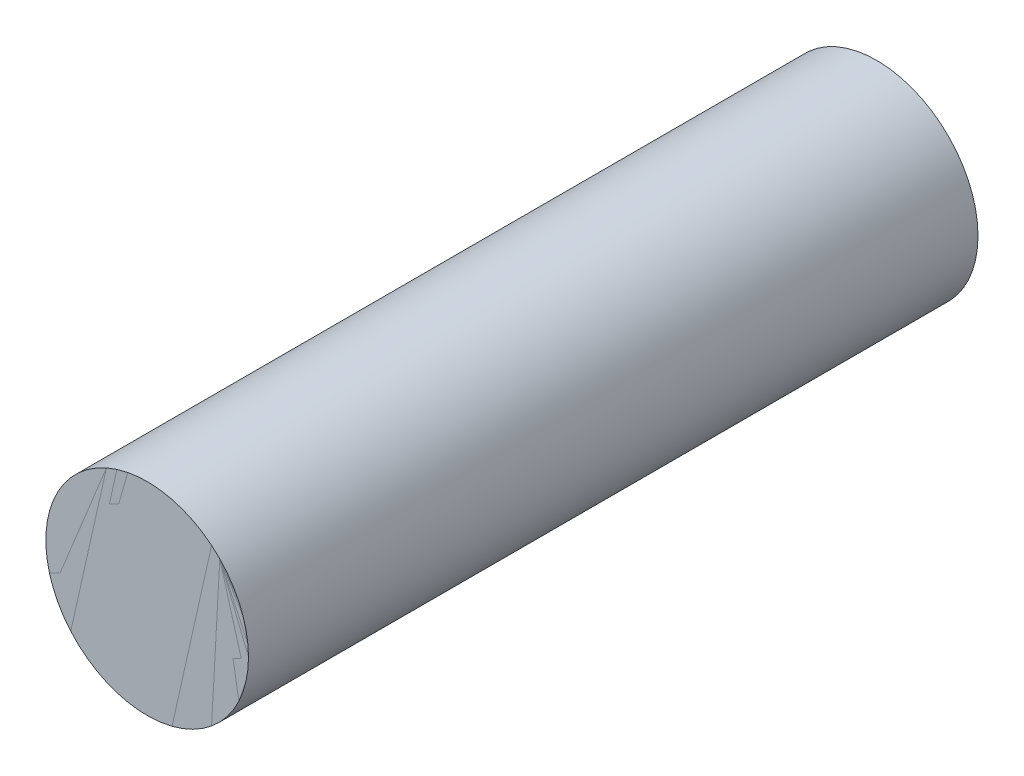
ISO-10303-21;
HEADER;
FILE_DESCRIPTION(('STEP AP214'),'2;1');
FILE_NAME('part.step','',(''),(''),'','','');
FILE_SCHEMA(('AUTOMOTIVE_DESIGN { 1 0 10303 214 1 1 1 1 }'));
ENDSEC;
DATA;
#1=APPLICATION_CONTEXT('core data for automotive mechanical design processes');
#2=APPLICATION_PROTOCOL_DEFINITION('international standard','automotive_design',2000,#1);
#3=PRODUCT_CONTEXT('',#1,'mechanical');
#4=PRODUCT('Part','Part','',(#3));
#5=PRODUCT_RELATED_PRODUCT_CATEGORY('part','',(#4));
#6=PRODUCT_DEFINITION_FORMATION('','',#4);
#7=PRODUCT_DEFINITION_CONTEXT('part definition',#1,'design');
#8=PRODUCT_DEFINITION('design','',#6,#7);
#9=PRODUCT_DEFINITION_SHAPE('','',#8);
#10=(LENGTH_UNIT() NAMED_UNIT(*) SI_UNIT(.MILLI.,.METRE.));
#11=(NAMED_UNIT(*) PLANE_ANGLE_UNIT() SI_UNIT($,.RADIAN.));
#12=(NAMED_UNIT(*) SI_UNIT($,.STERADIAN.) SOLID_ANGLE_UNIT());
#13=UNCERTAINTY_MEASURE_WITH_UNIT(LENGTH_MEASURE(1.E-05),#10,'distance_accuracy_value','');
#14=(GEOMETRIC_REPRESENTATION_CONTEXT(3) GLOBAL_UNCERTAINTY_ASSIGNED_CONTEXT((#13)) GLOBAL_UNIT_ASSIGNED_CONTEXT((#10,
#11,#12)) REPRESENTATION_CONTEXT('',''));
#15=CARTESIAN_POINT('',(0.,0.,0.));
#16=DIRECTION('',(0.,0.,1.));
#17=DIRECTION('',(1.,0.,0.));
#18=AXIS2_PLACEMENT_3D('',#15,#16,#17);
#19=CARTESIAN_POINT('',(-110.435261655171,-76.8999546142995,-1.8));
#20=DIRECTION('',(0.,0.,1.));
#21=DIRECTION('',(1.,0.,0.));
#22=AXIS2_PLACEMENT_3D('',#19,#20,#21);
#23=CYLINDRICAL_SURFACE('',#22,0.25);
#24=CARTESIAN_POINT('',(-110.435261655171,-76.8999546142995,-1.8));
#25=DIRECTION('',(0.,0.,1.));
#26=DIRECTION('',(1.,0.,0.));
#27=AXIS2_PLACEMENT_3D('',#24,#25,#26);
#28=CIRCLE('',#27,0.25);
#29=CARTESIAN_POINT('',(-110.185261655171,-76.8999546142995,-1.8));
#30=VERTEX_POINT('',#29);
#31=EDGE_CURVE('E11',#30,#30,#28,.T.);
#32=ORIENTED_EDGE('',*,*,#31,.T.);
#33=EDGE_LOOP('',(#32));
#34=FACE_BOUND('',#33,.T.);
#35=CARTESIAN_POINT('',(-110.435261655171,-76.8999546142995,0.));
#36=DIRECTION('',(0.,0.,1.));
#37=DIRECTION('',(1.,0.,0.));
#38=AXIS2_PLACEMENT_3D('',#35,#36,#37);
#39=CIRCLE('',#38,0.25);
#40=CARTESIAN_POINT('',(-110.185261655171,-76.8999546142995,0.));
#41=VERTEX_POINT('',#40);
#42=EDGE_CURVE('E46',#41,#41,#39,.T.);
#43=ORIENTED_EDGE('',*,*,#42,.F.);
#44=EDGE_LOOP('',(#43));
#45=FACE_BOUND('',#44,.T.);
#46=ADVANCED_FACE('F43',(#34,#45),#23,.T.);
#47=CARTESIAN_POINT('',(-110.435261655171,-76.8999546142995,-1.8));
#48=DIRECTION('',(0.,0.,1.));
#49=DIRECTION('',(1.,0.,0.));
#50=AXIS2_PLACEMENT_3D('',#47,#48,#49);
#51=PLANE('',#50);
#52=ORIENTED_EDGE('',*,*,#31,.F.);
#53=EDGE_LOOP('',(#52));
#54=FACE_BOUND('',#53,.T.);
#55=ADVANCED_FACE('F58',(#54),#51,.F.);
#56=CARTESIAN_POINT('',(-110.435261655171,-76.8999546142995,0.));
#57=DIRECTION('',(0.,0.,1.));
#58=DIRECTION('',(1.,0.,0.));
#59=AXIS2_PLACEMENT_3D('',#56,#57,#58);
#60=PLANE('',#59);
#61=ORIENTED_EDGE('',*,*,#42,.T.);
#62=EDGE_LOOP('',(#61));
#63=FACE_BOUND('',#62,.T.);
#64=ADVANCED_FACE('F55',(#63),#60,.T.);
#65=CLOSED_SHELL('',(#46,#55,#64));
#66=MANIFOLD_SOLID_BREP('B2',#65);
#67=CARTESIAN_POINT('',(-110.435261655171,-76.8999546142995,0.));
#68=DIRECTION('',(0.,0.,1.));
#69=DIRECTION('',(1.,0.,0.));
#70=AXIS2_PLACEMENT_3D('',#67,#68,#69);
#71=PLANE('',#70);
#72=CARTESIAN_POINT('',(-110.435261655171,-76.8999546142995,0.));
#73=DIRECTION('',(0.,0.,1.));
#74=DIRECTION('',(1.,0.,0.));
#75=AXIS2_PLACEMENT_3D('',#72,#73,#74);
#76=CIRCLE('',#75,0.25);
#77=CARTESIAN_POINT('',(-110.185261655171,-76.8999546142995,0.));
#78=VERTEX_POINT('',#77);
#79=EDGE_CURVE('E42',#78,#78,#76,.F.);
#80=ORIENTED_EDGE('',*,*,#79,.F.);
#81=EDGE_LOOP('',(#80));
#82=FACE_BOUND('',#81,.T.);
#83=ADVANCED_FACE('F83',(#82),#71,.T.);
#84=OPEN_SHELL('',(#83));
#85=SHELL_BASED_SURFACE_MODEL('B6',(#84));
#86=ADVANCED_BREP_SHAPE_REPRESENTATION('',(#18,#66),#14);
#87=MANIFOLD_SURFACE_SHAPE_REPRESENTATION('',(#18,#85),#14);
#88=SHAPE_REPRESENTATION('',(#18),#14);
#89=SHAPE_DEFINITION_REPRESENTATION(#9,#88);
#90=SHAPE_REPRESENTATION_RELATIONSHIP('','',#88,#86);
#91=SHAPE_REPRESENTATION_RELATIONSHIP('','',#88,#87);
ENDSEC;
END-ISO-10303-21;
